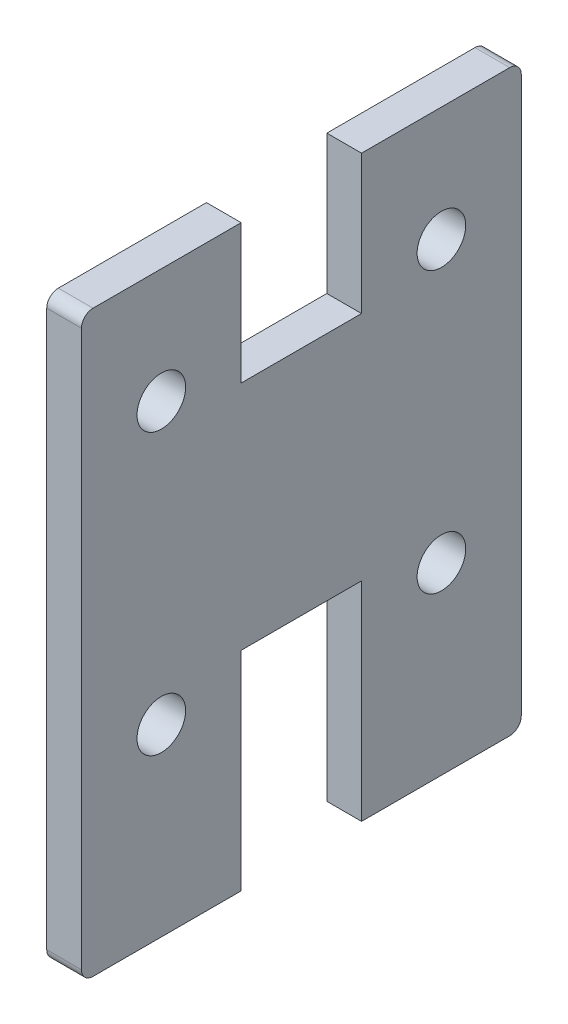
ISO-10303-21;
HEADER;
FILE_DESCRIPTION(('STEP AP214'),'2;1');
FILE_NAME('part.step','',(''),(''),'','','');
FILE_SCHEMA(('AUTOMOTIVE_DESIGN { 1 0 10303 214 1 1 1 1 }'));
ENDSEC;
DATA;
#1=APPLICATION_CONTEXT('core data for automotive mechanical design processes');
#2=APPLICATION_PROTOCOL_DEFINITION('international standard','automotive_design',2000,#1);
#3=PRODUCT_CONTEXT('',#1,'mechanical');
#4=PRODUCT('Part','Part','',(#3));
#5=PRODUCT_RELATED_PRODUCT_CATEGORY('part','',(#4));
#6=PRODUCT_DEFINITION_FORMATION('','',#4);
#7=PRODUCT_DEFINITION_CONTEXT('part definition',#1,'design');
#8=PRODUCT_DEFINITION('design','',#6,#7);
#9=PRODUCT_DEFINITION_SHAPE('','',#8);
#10=(LENGTH_UNIT() NAMED_UNIT(*) SI_UNIT(.MILLI.,.METRE.));
#11=(NAMED_UNIT(*) PLANE_ANGLE_UNIT() SI_UNIT($,.RADIAN.));
#12=(NAMED_UNIT(*) SI_UNIT($,.STERADIAN.) SOLID_ANGLE_UNIT());
#13=UNCERTAINTY_MEASURE_WITH_UNIT(LENGTH_MEASURE(1.E-05),#10,'distance_accuracy_value','');
#14=(GEOMETRIC_REPRESENTATION_CONTEXT(3) GLOBAL_UNCERTAINTY_ASSIGNED_CONTEXT((#13)) GLOBAL_UNIT_ASSIGNED_CONTEXT((#10,
#11,#12)) REPRESENTATION_CONTEXT('',''));
#15=CARTESIAN_POINT('',(0.,0.,0.));
#16=DIRECTION('',(0.,0.,1.));
#17=DIRECTION('',(1.,0.,0.));
#18=AXIS2_PLACEMENT_3D('',#15,#16,#17);
#19=CARTESIAN_POINT('',(-14.9999999999997,109.799999999999,96.0000000000015));
#20=DIRECTION('',(0.,-1.,0.));
#21=DIRECTION('',(0.,0.,-1.));
#22=AXIS2_PLACEMENT_3D('',#19,#20,#21);
#23=PLANE('',#22);
#24=DIRECTION('',(-1.00000000000002,0.,0.));
#25=VECTOR('',#24,1.);
#26=CARTESIAN_POINT('',(-14.9999999999997,109.799999999999,91.0000000000015));
#27=LINE('',#26,#25);
#28=CARTESIAN_POINT('',(-1.72723934494946E-12,109.800000000004,91.0000000000014));
#29=VERTEX_POINT('',#28);
#30=CARTESIAN_POINT('',(-14.9999999999997,109.799999999999,91.0000000000015));
#31=VERTEX_POINT('',#30);
#32=EDGE_CURVE('E11',#29,#31,#27,.T.);
#33=ORIENTED_EDGE('',*,*,#32,.F.);
#34=DIRECTION('',(0.,0.,1.));
#35=VECTOR('',#34,1.);
#36=CARTESIAN_POINT('',(-1.66424705339657E-12,109.800000000004,0.999999999999976));
#37=LINE('',#36,#35);
#38=CARTESIAN_POINT('',(-1.68244482651185E-12,109.800000000004,27.));
#39=VERTEX_POINT('',#38);
#40=EDGE_CURVE('E130',#29,#39,#37,.F.);
#41=ORIENTED_EDGE('',*,*,#40,.T.);
#42=DIRECTION('',(-1.00000000000002,0.,0.));
#43=VECTOR('',#42,1.);
#44=CARTESIAN_POINT('',(-14.9999999999997,109.799999999999,27.));
#45=LINE('',#44,#43);
#46=CARTESIAN_POINT('',(-14.9999999999997,109.799999999999,27.));
#47=VERTEX_POINT('',#46);
#48=EDGE_CURVE('E47',#39,#47,#45,.T.);
#49=ORIENTED_EDGE('',*,*,#48,.T.);
#50=DIRECTION('',(0.,0.,-1.));
#51=VECTOR('',#50,1.);
#52=CARTESIAN_POINT('',(-14.9999999999997,109.799999999999,96.0000000000015));
#53=LINE('',#52,#51);
#54=EDGE_CURVE('E229',#31,#47,#53,.T.);
#55=ORIENTED_EDGE('',*,*,#54,.F.);
#56=EDGE_LOOP('',(#33,#41,#49,#55));
#57=FACE_BOUND('',#56,.T.);
#58=ADVANCED_FACE('F37',(#57),#23,.F.);
#59=CARTESIAN_POINT('',(-14.9999999999997,109.799999999999,27.));
#60=DIRECTION('',(0.,0.,1.));
#61=DIRECTION('',(0.,-1.,0.));
#62=AXIS2_PLACEMENT_3D('',#59,#60,#61);
#63=PLANE('',#62);
#64=ORIENTED_EDGE('',*,*,#48,.F.);
#65=DIRECTION('',(0.,-1.00000000000002,0.));
#66=VECTOR('',#65,1.);
#67=CARTESIAN_POINT('',(4.05074755023061E-13,-0.199999999999845,27.));
#68=LINE('',#67,#66);
#69=CARTESIAN_POINT('',(-5.43797782038269E-13,49.8000000000023,27.));
#70=VERTEX_POINT('',#69);
#71=EDGE_CURVE('E173',#39,#70,#68,.T.);
#72=ORIENTED_EDGE('',*,*,#71,.T.);
#73=DIRECTION('',(-1.00000000000002,0.,0.));
#74=VECTOR('',#73,1.);
#75=CARTESIAN_POINT('',(-14.9999999999998,49.7999999999999,27.));
#76=LINE('',#75,#74);
#77=CARTESIAN_POINT('',(-14.9999999999998,49.7999999999999,27.));
#78=VERTEX_POINT('',#77);
#79=EDGE_CURVE('E222',#70,#78,#76,.T.);
#80=ORIENTED_EDGE('',*,*,#79,.T.);
#81=DIRECTION('',(0.,-1.,0.));
#82=VECTOR('',#81,1.);
#83=CARTESIAN_POINT('',(-14.9999999999997,109.799999999999,27.));
#84=LINE('',#83,#82);
#85=EDGE_CURVE('E239',#47,#78,#84,.T.);
#86=ORIENTED_EDGE('',*,*,#85,.F.);
#87=EDGE_LOOP('',(#64,#72,#80,#86));
#88=FACE_BOUND('',#87,.T.);
#89=ADVANCED_FACE('F242',(#88),#63,.F.);
#90=CARTESIAN_POINT('',(-14.9999999999998,49.7999999999999,27.));
#91=DIRECTION('',(0.,-1.,0.));
#92=DIRECTION('',(0.,0.,-1.));
#93=AXIS2_PLACEMENT_3D('',#90,#91,#92);
#94=PLANE('',#93);
#95=ORIENTED_EDGE('',*,*,#79,.F.);
#96=DIRECTION('',(0.,0.,1.));
#97=VECTOR('',#96,1.);
#98=CARTESIAN_POINT('',(-5.2560000892299E-13,49.8000000000023,0.999999999999983));
#99=LINE('',#98,#97);
#100=CARTESIAN_POINT('',(-5.0740223580771E-13,49.8000000000023,-25.));
#101=VERTEX_POINT('',#100);
#102=EDGE_CURVE('E170',#70,#101,#99,.F.);
#103=ORIENTED_EDGE('',*,*,#102,.T.);
#104=DIRECTION('',(-1.00000000000002,0.,0.));
#105=VECTOR('',#104,1.);
#106=CARTESIAN_POINT('',(-14.9999999999996,49.7999999999999,-25.));
#107=LINE('',#106,#105);
#108=CARTESIAN_POINT('',(-14.9999999999996,49.7999999999999,-25.));
#109=VERTEX_POINT('',#108);
#110=EDGE_CURVE('E219',#101,#109,#107,.T.);
#111=ORIENTED_EDGE('',*,*,#110,.T.);
#112=DIRECTION('',(0.,0.,-1.));
#113=VECTOR('',#112,1.);
#114=CARTESIAN_POINT('',(-14.9999999999998,49.7999999999999,27.));
#115=LINE('',#114,#113);
#116=EDGE_CURVE('E243',#78,#109,#115,.T.);
#117=ORIENTED_EDGE('',*,*,#116,.F.);
#118=EDGE_LOOP('',(#95,#103,#111,#117));
#119=FACE_BOUND('',#118,.T.);
#120=ADVANCED_FACE('F313',(#119),#94,.F.);
#121=CARTESIAN_POINT('',(-14.9999999999997,109.799999999999,-25.));
#122=DIRECTION('',(0.,0.,1.));
#123=DIRECTION('',(0.,-1.,0.));
#124=AXIS2_PLACEMENT_3D('',#121,#122,#123);
#125=PLANE('',#124);
#126=ORIENTED_EDGE('',*,*,#110,.F.);
#127=DIRECTION('',(0.,-1.00000000000002,0.));
#128=VECTOR('',#127,1.);
#129=CARTESIAN_POINT('',(4.41470301253621E-13,-0.199999999999851,-25.));
#130=LINE('',#129,#128);
#131=CARTESIAN_POINT('',(-1.64604928028129E-12,109.800000000004,-25.));
#132=VERTEX_POINT('',#131);
#133=EDGE_CURVE('E167',#132,#101,#130,.T.);
#134=ORIENTED_EDGE('',*,*,#133,.F.);
#135=DIRECTION('',(-1.00000000000002,0.,0.));
#136=VECTOR('',#135,1.);
#137=CARTESIAN_POINT('',(-14.9999999999997,109.799999999999,-25.));
#138=LINE('',#137,#136);
#139=CARTESIAN_POINT('',(-14.9999999999997,109.799999999999,-25.));
#140=VERTEX_POINT('',#139);
#141=EDGE_CURVE('E216',#132,#140,#138,.T.);
#142=ORIENTED_EDGE('',*,*,#141,.T.);
#143=DIRECTION('',(0.,-1.,0.));
#144=VECTOR('',#143,1.);
#145=CARTESIAN_POINT('',(-14.9999999999997,109.799999999999,-25.));
#146=LINE('',#145,#144);
#147=EDGE_CURVE('E245',#140,#109,#146,.T.);
#148=ORIENTED_EDGE('',*,*,#147,.T.);
#149=EDGE_LOOP('',(#126,#134,#142,#148));
#150=FACE_BOUND('',#149,.T.);
#151=ADVANCED_FACE('F464',(#150),#125,.T.);
#152=CARTESIAN_POINT('',(-14.9999999999992,109.799999999999,-94.0000000000006));
#153=DIRECTION('',(0.,1.,0.));
#154=DIRECTION('',(0.,0.,1.));
#155=AXIS2_PLACEMENT_3D('',#152,#153,#154);
#156=PLANE('',#155);
#157=ORIENTED_EDGE('',*,*,#141,.F.);
#158=DIRECTION('',(0.,0.,1.));
#159=VECTOR('',#158,1.);
#160=CARTESIAN_POINT('',(-1.66424705339657E-12,109.800000000004,0.999999999999976));
#161=LINE('',#160,#159);
#162=CARTESIAN_POINT('',(-1.60125476184368E-12,109.800000000004,-89.0000000000007));
#163=VERTEX_POINT('',#162);
#164=EDGE_CURVE('E164',#163,#132,#161,.T.);
#165=ORIENTED_EDGE('',*,*,#164,.F.);
#166=DIRECTION('',(-1.00000000000002,0.,0.));
#167=VECTOR('',#166,1.);
#168=CARTESIAN_POINT('',(-14.9999999999981,109.799999999999,-89.0000000000006));
#169=LINE('',#168,#167);
#170=CARTESIAN_POINT('',(-14.9999999999981,109.799999999999,-89.0000000000006));
#171=VERTEX_POINT('',#170);
#172=EDGE_CURVE('E213',#163,#171,#169,.T.);
#173=ORIENTED_EDGE('',*,*,#172,.T.);
#174=DIRECTION('',(0.,0.,1.));
#175=VECTOR('',#174,1.);
#176=CARTESIAN_POINT('',(-14.9999999999992,109.799999999999,-94.0000000000006));
#177=LINE('',#176,#175);
#178=EDGE_CURVE('E251',#171,#140,#177,.T.);
#179=ORIENTED_EDGE('',*,*,#178,.T.);
#180=EDGE_LOOP('',(#157,#165,#173,#179));
#181=FACE_BOUND('',#180,.T.);
#182=ADVANCED_FACE('F454',(#181),#156,.T.);
#183=CARTESIAN_POINT('',(-14.9999999999983,104.799999999999,-89.0000000000014));
#184=DIRECTION('',(1.00000000000002,0.,0.));
#185=DIRECTION('',(0.,1.,0.));
#186=AXIS2_PLACEMENT_3D('',#183,#184,#185);
#187=CYLINDRICAL_SURFACE('',#186,5.);
#188=ORIENTED_EDGE('',*,*,#172,.F.);
#189=CARTESIAN_POINT('',(2.71310751642773E-12,104.799999999999,-89.0000000000014));
#190=DIRECTION('',(1.00000000000002,0.,0.));
#191=DIRECTION('',(0.,1.,0.));
#192=AXIS2_PLACEMENT_3D('',#189,#190,#191);
#193=CIRCLE('',#192,5.);
#194=CARTESIAN_POINT('',(-1.50286793638461E-12,104.800000000004,-94.0000000000015));
#195=VERTEX_POINT('',#194);
#196=EDGE_CURVE('E161',#163,#195,#193,.F.);
#197=ORIENTED_EDGE('',*,*,#196,.T.);
#198=DIRECTION('',(-1.00000000000002,0.,0.));
#199=VECTOR('',#198,1.);
#200=CARTESIAN_POINT('',(-14.9999999999983,104.799999999999,-94.0000000000015));
#201=LINE('',#200,#199);
#202=CARTESIAN_POINT('',(-14.9999999999983,104.799999999999,-94.0000000000015));
#203=VERTEX_POINT('',#202);
#204=EDGE_CURVE('E210',#195,#203,#201,.T.);
#205=ORIENTED_EDGE('',*,*,#204,.T.);
#206=CARTESIAN_POINT('',(-14.9999999999983,104.799999999999,-89.0000000000014));
#207=DIRECTION('',(1.00000000000002,0.,0.));
#208=DIRECTION('',(0.,0.,1.));
#209=AXIS2_PLACEMENT_3D('',#206,#207,#208);
#210=CIRCLE('',#209,5.);
#211=EDGE_CURVE('E254',#171,#203,#210,.F.);
#212=ORIENTED_EDGE('',*,*,#211,.F.);
#213=EDGE_LOOP('',(#188,#197,#205,#212));
#214=FACE_BOUND('',#213,.T.);
#215=ADVANCED_FACE('F444',(#214),#187,.T.);
#216=CARTESIAN_POINT('',(-15.0000000000052,-42.1037546673445,-94.000000000004));
#217=DIRECTION('',(0.,0.,-1.));
#218=DIRECTION('',(0.,1.,0.));
#219=AXIS2_PLACEMENT_3D('',#216,#217,#218);
#220=PLANE('',#219);
#221=ORIENTED_EDGE('',*,*,#204,.F.);
#222=DIRECTION('',(0.,-1.00000000000002,0.));
#223=VECTOR('',#222,1.);
#224=CARTESIAN_POINT('',(4.89764391444173E-13,-0.199999999999859,-94.000000000004));
#225=LINE('',#224,#223);
#226=CARTESIAN_POINT('',(3.05172024150981E-12,-135.200000000008,-94.000000000004));
#227=VERTEX_POINT('',#226);
#228=EDGE_CURVE('E158',#227,#195,#225,.F.);
#229=ORIENTED_EDGE('',*,*,#228,.F.);
#230=DIRECTION('',(-1.00000000000002,0.,0.));
#231=VECTOR('',#230,1.);
#232=CARTESIAN_POINT('',(-15.0000000000049,-135.200000000003,-94.000000000004));
#233=LINE('',#232,#231);
#234=CARTESIAN_POINT('',(-15.0000000000049,-135.200000000003,-94.000000000004));
#235=VERTEX_POINT('',#234);
#236=EDGE_CURVE('E207',#227,#235,#233,.T.);
#237=ORIENTED_EDGE('',*,*,#236,.T.);
#238=DIRECTION('',(0.,1.,0.));
#239=VECTOR('',#238,1.);
#240=CARTESIAN_POINT('',(-15.0000000000052,-42.1037546673445,-94.000000000004));
#241=LINE('',#240,#239);
#242=EDGE_CURVE('E257',#235,#203,#241,.T.);
#243=ORIENTED_EDGE('',*,*,#242,.T.);
#244=EDGE_LOOP('',(#221,#229,#237,#243));
#245=FACE_BOUND('',#244,.T.);
#246=ADVANCED_FACE('F434',(#245),#220,.T.);
#247=CARTESIAN_POINT('',(-15.0000000000049,-135.200000000003,-89.000000000004));
#248=DIRECTION('',(1.00000000000002,0.,0.));
#249=DIRECTION('',(0.,1.,0.));
#250=AXIS2_PLACEMENT_3D('',#247,#248,#249);
#251=CYLINDRICAL_SURFACE('',#250,5.);
#252=ORIENTED_EDGE('',*,*,#236,.F.);
#253=CARTESIAN_POINT('',(-3.89271948009196E-12,-135.200000000002,-89.000000000004));
#254=DIRECTION('',(1.00000000000002,0.,0.));
#255=DIRECTION('',(0.,1.,0.));
#256=AXIS2_PLACEMENT_3D('',#253,#254,#255);
#257=CIRCLE('',#256,5.);
#258=CARTESIAN_POINT('',(3.14310792346296E-12,-140.200000000006,-89.000000000004));
#259=VERTEX_POINT('',#258);
#260=EDGE_CURVE('E155',#227,#259,#257,.F.);
#261=ORIENTED_EDGE('',*,*,#260,.T.);
#262=DIRECTION('',(-1.00000000000002,0.,0.));
#263=VECTOR('',#262,1.);
#264=CARTESIAN_POINT('',(-15.0000000000016,-140.2,-89.000000000004));
#265=LINE('',#264,#263);
#266=CARTESIAN_POINT('',(-15.0000000000016,-140.2,-89.000000000004));
#267=VERTEX_POINT('',#266);
#268=EDGE_CURVE('E204',#259,#267,#265,.T.);
#269=ORIENTED_EDGE('',*,*,#268,.T.);
#270=CARTESIAN_POINT('',(-15.0000000000049,-135.200000000003,-89.000000000004));
#271=DIRECTION('',(1.00000000000002,0.,0.));
#272=DIRECTION('',(0.,0.,1.));
#273=AXIS2_PLACEMENT_3D('',#270,#271,#272);
#274=CIRCLE('',#273,5.);
#275=EDGE_CURVE('E260',#235,#267,#274,.F.);
#276=ORIENTED_EDGE('',*,*,#275,.F.);
#277=EDGE_LOOP('',(#252,#261,#269,#276));
#278=FACE_BOUND('',#277,.T.);
#279=ADVANCED_FACE('F424',(#278),#251,.T.);
#280=CARTESIAN_POINT('',(-15.0000000000032,-140.2,-94.000000000004));
#281=DIRECTION('',(0.,-1.,0.));
#282=DIRECTION('',(0.,0.,-1.));
#283=AXIS2_PLACEMENT_3D('',#280,#281,#282);
#284=PLANE('',#283);
#285=ORIENTED_EDGE('',*,*,#268,.F.);
#286=DIRECTION('',(0.,0.,1.));
#287=VECTOR('',#286,1.);
#288=CARTESIAN_POINT('',(3.08011563191005E-12,-140.200000000005,1.00000000000001));
#289=LINE('',#288,#287);
#290=CARTESIAN_POINT('',(3.09831340502532E-12,-140.200000000005,-24.9999999999999));
#291=VERTEX_POINT('',#290);
#292=EDGE_CURVE('E152',#291,#259,#289,.F.);
#293=ORIENTED_EDGE('',*,*,#292,.F.);
#294=DIRECTION('',(-1.00000000000002,0.,0.));
#295=VECTOR('',#294,1.);
#296=CARTESIAN_POINT('',(-15.0000000000049,-140.199999999999,-24.9999999999999));
#297=LINE('',#296,#295);
#298=CARTESIAN_POINT('',(-15.0000000000049,-140.199999999999,-24.9999999999999));
#299=VERTEX_POINT('',#298);
#300=EDGE_CURVE('E201',#291,#299,#297,.T.);
#301=ORIENTED_EDGE('',*,*,#300,.T.);
#302=DIRECTION('',(0.,0.,-1.));
#303=VECTOR('',#302,1.);
#304=CARTESIAN_POINT('',(-15.0000000000032,-140.2,-94.000000000004));
#305=LINE('',#304,#303);
#306=EDGE_CURVE('E263',#299,#267,#305,.T.);
#307=ORIENTED_EDGE('',*,*,#306,.T.);
#308=EDGE_LOOP('',(#285,#293,#301,#307));
#309=FACE_BOUND('',#308,.T.);
#310=ADVANCED_FACE('F414',(#309),#284,.T.);
#311=CARTESIAN_POINT('',(-15.0000000000049,-140.199999999999,-24.9999999999999));
#312=DIRECTION('',(0.,0.,1.));
#313=DIRECTION('',(0.,-1.,0.));
#314=AXIS2_PLACEMENT_3D('',#311,#312,#313);
#315=PLANE('',#314);
#316=ORIENTED_EDGE('',*,*,#300,.F.);
#317=DIRECTION('',(0.,-1.00000000000002,0.));
#318=VECTOR('',#317,1.);
#319=CARTESIAN_POINT('',(4.41470301253621E-13,-0.199999999999851,-25.));
#320=LINE('',#319,#318);
#321=CARTESIAN_POINT('',(1.39034283831495E-12,-50.200000000002,-25.));
#322=VERTEX_POINT('',#321);
#323=EDGE_CURVE('E149',#322,#291,#320,.T.);
#324=ORIENTED_EDGE('',*,*,#323,.F.);
#325=DIRECTION('',(-1.00000000000002,0.,0.));
#326=VECTOR('',#325,1.);
#327=CARTESIAN_POINT('',(-15.0000000000003,-50.2000000000001,-25.));
#328=LINE('',#327,#326);
#329=CARTESIAN_POINT('',(-15.0000000000003,-50.2000000000001,-25.));
#330=VERTEX_POINT('',#329);
#331=EDGE_CURVE('E198',#322,#330,#328,.T.);
#332=ORIENTED_EDGE('',*,*,#331,.T.);
#333=DIRECTION('',(0.,-1.,0.));
#334=VECTOR('',#333,1.);
#335=CARTESIAN_POINT('',(-15.0000000000049,-140.199999999999,-24.9999999999999));
#336=LINE('',#335,#334);
#337=EDGE_CURVE('E266',#330,#299,#336,.T.);
#338=ORIENTED_EDGE('',*,*,#337,.T.);
#339=EDGE_LOOP('',(#316,#324,#332,#338));
#340=FACE_BOUND('',#339,.T.);
#341=ADVANCED_FACE('F404',(#340),#315,.T.);
#342=CARTESIAN_POINT('',(-15.0000000000003,-50.2000000000001,27.));
#343=DIRECTION('',(0.,1.,0.));
#344=DIRECTION('',(0.,0.,1.));
#345=AXIS2_PLACEMENT_3D('',#342,#343,#344);
#346=PLANE('',#345);
#347=ORIENTED_EDGE('',*,*,#331,.F.);
#348=DIRECTION('',(0.,0.,1.));
#349=VECTOR('',#348,1.);
#350=CARTESIAN_POINT('',(1.37214506519967E-12,-50.200000000002,0.999999999999995));
#351=LINE('',#350,#349);
#352=CARTESIAN_POINT('',(1.35394729208439E-12,-50.200000000002,27.));
#353=VERTEX_POINT('',#352);
#354=EDGE_CURVE('E146',#322,#353,#351,.T.);
#355=ORIENTED_EDGE('',*,*,#354,.T.);
#356=DIRECTION('',(-1.00000000000002,0.,0.));
#357=VECTOR('',#356,1.);
#358=CARTESIAN_POINT('',(-15.0000000000003,-50.2000000000001,27.));
#359=LINE('',#358,#357);
#360=CARTESIAN_POINT('',(-15.0000000000003,-50.2000000000001,27.));
#361=VERTEX_POINT('',#360);
#362=EDGE_CURVE('E195',#353,#361,#359,.T.);
#363=ORIENTED_EDGE('',*,*,#362,.T.);
#364=DIRECTION('',(0.,0.,1.));
#365=VECTOR('',#364,1.);
#366=CARTESIAN_POINT('',(-15.0000000000003,-50.2000000000001,27.));
#367=LINE('',#366,#365);
#368=EDGE_CURVE('E269',#330,#361,#367,.T.);
#369=ORIENTED_EDGE('',*,*,#368,.F.);
#370=EDGE_LOOP('',(#347,#355,#363,#369));
#371=FACE_BOUND('',#370,.T.);
#372=ADVANCED_FACE('F394',(#371),#346,.F.);
#373=CARTESIAN_POINT('',(-15.0000000000006,-140.199999999999,27.));
#374=DIRECTION('',(0.,0.,1.));
#375=DIRECTION('',(0.,-1.,0.));
#376=AXIS2_PLACEMENT_3D('',#373,#374,#375);
#377=PLANE('',#376);
#378=ORIENTED_EDGE('',*,*,#362,.F.);
#379=DIRECTION('',(0.,-1.00000000000002,0.));
#380=VECTOR('',#379,1.);
#381=CARTESIAN_POINT('',(4.05074755023061E-13,-0.199999999999845,27.));
#382=LINE('',#381,#380);
#383=CARTESIAN_POINT('',(3.06191785879477E-12,-140.200000000005,27.));
#384=VERTEX_POINT('',#383);
#385=EDGE_CURVE('E143',#353,#384,#382,.T.);
#386=ORIENTED_EDGE('',*,*,#385,.T.);
#387=DIRECTION('',(-1.00000000000002,0.,0.));
#388=VECTOR('',#387,1.);
#389=CARTESIAN_POINT('',(-15.0000000000006,-140.199999999999,27.));
#390=LINE('',#389,#388);
#391=CARTESIAN_POINT('',(-15.0000000000006,-140.199999999999,27.));
#392=VERTEX_POINT('',#391);
#393=EDGE_CURVE('E192',#384,#392,#390,.T.);
#394=ORIENTED_EDGE('',*,*,#393,.T.);
#395=DIRECTION('',(0.,-1.,0.));
#396=VECTOR('',#395,1.);
#397=CARTESIAN_POINT('',(-15.0000000000006,-140.199999999999,27.));
#398=LINE('',#397,#396);
#399=EDGE_CURVE('E272',#361,#392,#398,.T.);
#400=ORIENTED_EDGE('',*,*,#399,.F.);
#401=EDGE_LOOP('',(#378,#386,#394,#400));
#402=FACE_BOUND('',#401,.T.);
#403=ADVANCED_FACE('F384',(#402),#377,.F.);
#404=CARTESIAN_POINT('',(-15.0000000000006,-140.2,96.000000000004));
#405=DIRECTION('',(0.,1.,0.));
#406=DIRECTION('',(0.,0.,1.));
#407=AXIS2_PLACEMENT_3D('',#404,#405,#406);
#408=PLANE('',#407);
#409=ORIENTED_EDGE('',*,*,#393,.F.);
#410=DIRECTION('',(0.,0.,1.));
#411=VECTOR('',#410,1.);
#412=CARTESIAN_POINT('',(3.08011563191005E-12,-140.200000000005,1.00000000000001));
#413=LINE('',#412,#411);
#414=CARTESIAN_POINT('',(3.01712334035716E-12,-140.200000000005,91.000000000004));
#415=VERTEX_POINT('',#414);
#416=EDGE_CURVE('E140',#384,#415,#413,.T.);
#417=ORIENTED_EDGE('',*,*,#416,.T.);
#418=DIRECTION('',(-1.00000000000002,0.,0.));
#419=VECTOR('',#418,1.);
#420=CARTESIAN_POINT('',(-15.0000000000006,-140.2,91.000000000004));
#421=LINE('',#420,#419);
#422=CARTESIAN_POINT('',(-15.0000000000006,-140.2,91.000000000004));
#423=VERTEX_POINT('',#422);
#424=EDGE_CURVE('E190',#415,#423,#421,.T.);
#425=ORIENTED_EDGE('',*,*,#424,.T.);
#426=DIRECTION('',(0.,0.,1.));
#427=VECTOR('',#426,1.);
#428=CARTESIAN_POINT('',(-15.0000000000006,-140.2,96.000000000004));
#429=LINE('',#428,#427);
#430=EDGE_CURVE('E275',#392,#423,#429,.T.);
#431=ORIENTED_EDGE('',*,*,#430,.F.);
#432=EDGE_LOOP('',(#409,#417,#425,#431));
#433=FACE_BOUND('',#432,.T.);
#434=ADVANCED_FACE('F375',(#433),#408,.F.);
#435=CARTESIAN_POINT('',(-15.0000000000025,-135.200000000002,91.000000000004));
#436=DIRECTION('',(1.00000000000002,0.,0.));
#437=DIRECTION('',(0.,1.,0.));
#438=AXIS2_PLACEMENT_3D('',#435,#436,#437);
#439=CYLINDRICAL_SURFACE('',#438,5.);
#440=ORIENTED_EDGE('',*,*,#424,.F.);
#441=CARTESIAN_POINT('',(-1.5334955527635E-12,-135.200000000002,91.000000000004));
#442=DIRECTION('',(1.00000000000002,0.,0.));
#443=DIRECTION('',(0.,1.,0.));
#444=AXIS2_PLACEMENT_3D('',#441,#442,#443);
#445=CIRCLE('',#444,5.);
#446=CARTESIAN_POINT('',(2.91873651489813E-12,-135.200000000007,96.000000000004));
#447=VERTEX_POINT('',#446);
#448=EDGE_CURVE('E137',#415,#447,#445,.F.);
#449=ORIENTED_EDGE('',*,*,#448,.T.);
#450=DIRECTION('',(-1.00000000000002,0.,0.));
#451=VECTOR('',#450,1.);
#452=CARTESIAN_POINT('',(-15.0000000000049,-135.200000000002,96.000000000004));
#453=LINE('',#452,#451);
#454=CARTESIAN_POINT('',(-15.0000000000049,-135.200000000002,96.000000000004));
#455=VERTEX_POINT('',#454);
#456=EDGE_CURVE('E55',#447,#455,#453,.T.);
#457=ORIENTED_EDGE('',*,*,#456,.T.);
#458=CARTESIAN_POINT('',(-15.0000000000025,-135.200000000002,91.000000000004));
#459=DIRECTION('',(1.00000000000002,0.,0.));
#460=DIRECTION('',(0.,0.,1.));
#461=AXIS2_PLACEMENT_3D('',#458,#459,#460);
#462=CIRCLE('',#461,5.);
#463=EDGE_CURVE('E278',#423,#455,#462,.F.);
#464=ORIENTED_EDGE('',*,*,#463,.F.);
#465=EDGE_LOOP('',(#440,#449,#457,#464));
#466=FACE_BOUND('',#465,.T.);
#467=ADVANCED_FACE('F367',(#466),#439,.T.);
#468=CARTESIAN_POINT('',(-15.0000000000045,-42.1037546673445,96.000000000004));
#469=DIRECTION('',(0.,0.,-1.));
#470=DIRECTION('',(0.,1.,0.));
#471=AXIS2_PLACEMENT_3D('',#468,#469,#470);
#472=PLANE('',#471);
#473=ORIENTED_EDGE('',*,*,#456,.F.);
#474=DIRECTION('',(0.,-1.00000000000002,0.));
#475=VECTOR('',#474,1.);
#476=CARTESIAN_POINT('',(3.56780664832509E-13,-0.199999999999837,96.000000000004));
#477=LINE('',#476,#475);
#478=CARTESIAN_POINT('',(-1.63585166299627E-12,104.800000000004,96.0000000000019));
#479=VERTEX_POINT('',#478);
#480=EDGE_CURVE('E128',#447,#479,#477,.F.);
#481=ORIENTED_EDGE('',*,*,#480,.T.);
#482=DIRECTION('',(-1.00000000000002,0.,0.));
#483=VECTOR('',#482,1.);
#484=CARTESIAN_POINT('',(-14.9999999999998,104.799999999999,96.0000000000019));
#485=LINE('',#484,#483);
#486=CARTESIAN_POINT('',(-14.9999999999998,104.799999999999,96.0000000000019));
#487=VERTEX_POINT('',#486);
#488=EDGE_CURVE('E41',#479,#487,#485,.T.);
#489=ORIENTED_EDGE('',*,*,#488,.T.);
#490=DIRECTION('',(0.,1.,0.));
#491=VECTOR('',#490,1.);
#492=CARTESIAN_POINT('',(-15.0000000000045,-42.1037546673445,96.000000000004));
#493=LINE('',#492,#491);
#494=EDGE_CURVE('E188',#455,#487,#493,.T.);
#495=ORIENTED_EDGE('',*,*,#494,.F.);
#496=EDGE_LOOP('',(#473,#481,#489,#495));
#497=FACE_BOUND('',#496,.T.);
#498=ADVANCED_FACE('F132',(#497),#472,.F.);
#499=CARTESIAN_POINT('',(-14.9999999999988,104.799999999999,91.000000000002));
#500=DIRECTION('',(1.00000000000002,0.,0.));
#501=DIRECTION('',(0.,1.,0.));
#502=AXIS2_PLACEMENT_3D('',#499,#500,#501);
#503=CYLINDRICAL_SURFACE('',#502,5.);
#504=CARTESIAN_POINT('',(2.15799600411515E-12,104.799999999999,91.000000000002));
#505=DIRECTION('',(1.00000000000002,0.,0.));
#506=DIRECTION('',(0.,1.,0.));
#507=AXIS2_PLACEMENT_3D('',#504,#505,#506);
#508=CIRCLE('',#507,5.);
#509=EDGE_CURVE('E116',#479,#29,#508,.F.);
#510=ORIENTED_EDGE('',*,*,#509,.T.);
#511=ORIENTED_EDGE('',*,*,#32,.T.);
#512=CARTESIAN_POINT('',(-14.9999999999988,104.799999999999,91.000000000002));
#513=DIRECTION('',(1.00000000000002,0.,0.));
#514=DIRECTION('',(0.,0.,1.));
#515=AXIS2_PLACEMENT_3D('',#512,#513,#514);
#516=CIRCLE('',#515,5.);
#517=EDGE_CURVE('E118',#487,#31,#516,.F.);
#518=ORIENTED_EDGE('',*,*,#517,.F.);
#519=ORIENTED_EDGE('',*,*,#488,.F.);
#520=EDGE_LOOP('',(#510,#511,#518,#519));
#521=FACE_BOUND('',#520,.T.);
#522=ADVANCED_FACE('F115',(#521),#503,.T.);
#523=CARTESIAN_POINT('',(-15.0000000000002,-60.7000000000001,61.5000000000039));
#524=DIRECTION('',(1.00000000000002,0.,0.));
#525=DIRECTION('',(0.,1.,0.));
#526=AXIS2_PLACEMENT_3D('',#523,#524,#525);
#527=CYLINDRICAL_SURFACE('',#526,10.5);
#528=CARTESIAN_POINT('',(-15.0000000000002,-60.7000000000001,61.5000000000039));
#529=DIRECTION('',(-1.00000000000002,0.,0.));
#530=DIRECTION('',(0.,0.,-1.));
#531=AXIS2_PLACEMENT_3D('',#528,#529,#530);
#532=CIRCLE('',#531,10.5);
#533=CARTESIAN_POINT('',(-15.0000000000002,-60.7000000000001,51.0000000000039));
#534=VERTEX_POINT('',#533);
#535=EDGE_CURVE('E281',#534,#534,#532,.T.);
#536=ORIENTED_EDGE('',*,*,#535,.T.);
#537=EDGE_LOOP('',(#536));
#538=FACE_BOUND('',#537,.T.);
#539=CARTESIAN_POINT('',(7.97972798949331E-13,-60.6999999999998,61.5000000000039));
#540=DIRECTION('',(-1.00000000000002,0.,0.));
#541=DIRECTION('',(0.,-1.,0.));
#542=AXIS2_PLACEMENT_3D('',#539,#540,#541);
#543=CIRCLE('',#542,10.5);
#544=CARTESIAN_POINT('',(9.97236031732202E-13,-71.1999999999998,61.5000000000039));
#545=VERTEX_POINT('',#544);
#546=EDGE_CURVE('E139',#545,#545,#543,.T.);
#547=ORIENTED_EDGE('',*,*,#546,.F.);
#548=EDGE_LOOP('',(#547));
#549=FACE_BOUND('',#548,.T.);
#550=ADVANCED_FACE('F319',(#538,#549),#527,.F.);
#551=CARTESIAN_POINT('',(-14.9999999999977,60.2999999999996,61.5000000000019));
#552=DIRECTION('',(1.00000000000002,0.,0.));
#553=DIRECTION('',(0.,1.,0.));
#554=AXIS2_PLACEMENT_3D('',#551,#552,#553);
#555=CYLINDRICAL_SURFACE('',#554,10.5);
#556=CARTESIAN_POINT('',(-14.9999999999977,60.2999999999996,61.5000000000019));
#557=DIRECTION('',(-1.00000000000002,0.,0.));
#558=DIRECTION('',(0.,0.,-1.));
#559=AXIS2_PLACEMENT_3D('',#556,#557,#558);
#560=CIRCLE('',#559,10.5);
#561=CARTESIAN_POINT('',(-14.9999999999977,60.2999999999996,51.0000000000019));
#562=VERTEX_POINT('',#561);
#563=EDGE_CURVE('E284',#562,#562,#560,.T.);
#564=ORIENTED_EDGE('',*,*,#563,.T.);
#565=EDGE_LOOP('',(#564));
#566=FACE_BOUND('',#565,.T.);
#567=CARTESIAN_POINT('',(3.2682190287403E-12,60.2999999999998,61.5000000000019));
#568=DIRECTION('',(-1.00000000000002,0.,0.));
#569=DIRECTION('',(0.,-1.,0.));
#570=AXIS2_PLACEMENT_3D('',#567,#568,#569);
#571=CIRCLE('',#570,10.5);
#572=CARTESIAN_POINT('',(3.46748226152318E-12,49.7999999999998,61.5000000000019));
#573=VERTEX_POINT('',#572);
#574=EDGE_CURVE('E179',#573,#573,#571,.T.);
#575=ORIENTED_EDGE('',*,*,#574,.F.);
#576=EDGE_LOOP('',(#575));
#577=FACE_BOUND('',#576,.T.);
#578=ADVANCED_FACE('F322',(#566,#577),#555,.F.);
#579=CARTESIAN_POINT('',(-14.9999999999975,60.2999999999995,-59.5000000000015));
#580=DIRECTION('',(1.00000000000002,0.,0.));
#581=DIRECTION('',(0.,1.,0.));
#582=AXIS2_PLACEMENT_3D('',#579,#580,#581);
#583=CYLINDRICAL_SURFACE('',#582,10.5);
#584=CARTESIAN_POINT('',(-14.9999999999975,60.2999999999995,-59.5000000000015));
#585=DIRECTION('',(1.00000000000002,0.,0.));
#586=DIRECTION('',(0.,0.,1.));
#587=AXIS2_PLACEMENT_3D('',#584,#585,#586);
#588=CIRCLE('',#587,10.5);
#589=CARTESIAN_POINT('',(-14.9999999999975,60.2999999999995,-49.0000000000015));
#590=VERTEX_POINT('',#589);
#591=EDGE_CURVE('E286',#590,#590,#588,.T.);
#592=ORIENTED_EDGE('',*,*,#591,.F.);
#593=EDGE_LOOP('',(#592));
#594=FACE_BOUND('',#593,.T.);
#595=CARTESIAN_POINT('',(3.49026363366534E-12,60.2999999999998,-59.5000000000016));
#596=DIRECTION('',(1.00000000000002,0.,0.));
#597=DIRECTION('',(0.,1.,0.));
#598=AXIS2_PLACEMENT_3D('',#595,#596,#597);
#599=CIRCLE('',#598,10.5);
#600=CARTESIAN_POINT('',(3.29100040088247E-12,70.7999999999998,-59.5000000000016));
#601=VERTEX_POINT('',#600);
#602=EDGE_CURVE('E182',#601,#601,#599,.T.);
#603=ORIENTED_EDGE('',*,*,#602,.T.);
#604=EDGE_LOOP('',(#603));
#605=FACE_BOUND('',#604,.T.);
#606=ADVANCED_FACE('F296',(#594,#605),#583,.F.);
#607=CARTESIAN_POINT('',(-15.0000000000001,-60.7000000000001,-59.5000000000039));
#608=DIRECTION('',(1.00000000000002,0.,0.));
#609=DIRECTION('',(0.,1.,0.));
#610=AXIS2_PLACEMENT_3D('',#607,#608,#609);
#611=CYLINDRICAL_SURFACE('',#610,10.5);
#612=CARTESIAN_POINT('',(-15.0000000000001,-60.7000000000001,-59.5000000000039));
#613=DIRECTION('',(1.00000000000002,0.,0.));
#614=DIRECTION('',(0.,0.,1.));
#615=AXIS2_PLACEMENT_3D('',#612,#613,#614);
#616=CIRCLE('',#615,10.5);
#617=CARTESIAN_POINT('',(-15.0000000000001,-60.7000000000001,-49.0000000000039));
#618=VERTEX_POINT('',#617);
#619=EDGE_CURVE('E122',#618,#618,#616,.T.);
#620=ORIENTED_EDGE('',*,*,#619,.F.);
#621=EDGE_LOOP('',(#620));
#622=FACE_BOUND('',#621,.T.);
#623=CARTESIAN_POINT('',(9.08995101411847E-13,-60.6999999999998,-59.5000000000039));
#624=DIRECTION('',(1.00000000000002,0.,0.));
#625=DIRECTION('',(0.,1.,0.));
#626=AXIS2_PLACEMENT_3D('',#623,#624,#625);
#627=CIRCLE('',#626,10.5);
#628=CARTESIAN_POINT('',(7.09731868628976E-13,-50.1999999999998,-59.5000000000039));
#629=VERTEX_POINT('',#628);
#630=EDGE_CURVE('E185',#629,#629,#627,.T.);
#631=ORIENTED_EDGE('',*,*,#630,.T.);
#632=EDGE_LOOP('',(#631));
#633=FACE_BOUND('',#632,.T.);
#634=ADVANCED_FACE('F39',(#622,#633),#611,.F.);
#635=CARTESIAN_POINT('',(-14.9999999999999,-0.200000000000132,1.));
#636=DIRECTION('',(1.00000000000002,0.,0.));
#637=DIRECTION('',(0.,0.,1.));
#638=AXIS2_PLACEMENT_3D('',#635,#636,#637);
#639=PLANE('',#638);
#640=ORIENTED_EDGE('',*,*,#494,.T.);
#641=ORIENTED_EDGE('',*,*,#517,.T.);
#642=ORIENTED_EDGE('',*,*,#54,.T.);
#643=ORIENTED_EDGE('',*,*,#85,.T.);
#644=ORIENTED_EDGE('',*,*,#116,.T.);
#645=ORIENTED_EDGE('',*,*,#147,.F.);
#646=ORIENTED_EDGE('',*,*,#178,.F.);
#647=ORIENTED_EDGE('',*,*,#211,.T.);
#648=ORIENTED_EDGE('',*,*,#242,.F.);
#649=ORIENTED_EDGE('',*,*,#275,.T.);
#650=ORIENTED_EDGE('',*,*,#306,.F.);
#651=ORIENTED_EDGE('',*,*,#337,.F.);
#652=ORIENTED_EDGE('',*,*,#368,.T.);
#653=ORIENTED_EDGE('',*,*,#399,.T.);
#654=ORIENTED_EDGE('',*,*,#430,.T.);
#655=ORIENTED_EDGE('',*,*,#463,.T.);
#656=EDGE_LOOP('',(#640,#641,#642,#643,#644,#645,#646,#647,#648,#649,#650,#651,#652,#653,#654,#655));
#657=FACE_BOUND('',#656,.T.);
#658=ORIENTED_EDGE('',*,*,#535,.F.);
#659=EDGE_LOOP('',(#658));
#660=FACE_BOUND('',#659,.T.);
#661=ORIENTED_EDGE('',*,*,#563,.F.);
#662=EDGE_LOOP('',(#661));
#663=FACE_BOUND('',#662,.T.);
#664=ORIENTED_EDGE('',*,*,#591,.T.);
#665=EDGE_LOOP('',(#664));
#666=FACE_BOUND('',#665,.T.);
#667=ORIENTED_EDGE('',*,*,#619,.T.);
#668=EDGE_LOOP('',(#667));
#669=FACE_BOUND('',#668,.T.);
#670=ADVANCED_FACE('F236',(#657,#660,#663,#666,#669),#639,.F.);
#671=CARTESIAN_POINT('',(4.23272528138341E-13,-0.199999999999848,0.999999999999989));
#672=DIRECTION('',(1.00000000000002,0.,0.));
#673=DIRECTION('',(0.,0.,1.));
#674=AXIS2_PLACEMENT_3D('',#671,#672,#673);
#675=PLANE('',#674);
#676=ORIENTED_EDGE('',*,*,#480,.F.);
#677=ORIENTED_EDGE('',*,*,#448,.F.);
#678=ORIENTED_EDGE('',*,*,#416,.F.);
#679=ORIENTED_EDGE('',*,*,#385,.F.);
#680=ORIENTED_EDGE('',*,*,#354,.F.);
#681=ORIENTED_EDGE('',*,*,#323,.T.);
#682=ORIENTED_EDGE('',*,*,#292,.T.);
#683=ORIENTED_EDGE('',*,*,#260,.F.);
#684=ORIENTED_EDGE('',*,*,#228,.T.);
#685=ORIENTED_EDGE('',*,*,#196,.F.);
#686=ORIENTED_EDGE('',*,*,#164,.T.);
#687=ORIENTED_EDGE('',*,*,#133,.T.);
#688=ORIENTED_EDGE('',*,*,#102,.F.);
#689=ORIENTED_EDGE('',*,*,#71,.F.);
#690=ORIENTED_EDGE('',*,*,#40,.F.);
#691=ORIENTED_EDGE('',*,*,#509,.F.);
#692=EDGE_LOOP('',(#676,#677,#678,#679,#680,#681,#682,#683,#684,#685,#686,#687,#688,#689,#690,#691));
#693=FACE_BOUND('',#692,.T.);
#694=ORIENTED_EDGE('',*,*,#546,.T.);
#695=EDGE_LOOP('',(#694));
#696=FACE_BOUND('',#695,.T.);
#697=ORIENTED_EDGE('',*,*,#574,.T.);
#698=EDGE_LOOP('',(#697));
#699=FACE_BOUND('',#698,.T.);
#700=ORIENTED_EDGE('',*,*,#602,.F.);
#701=EDGE_LOOP('',(#700));
#702=FACE_BOUND('',#701,.T.);
#703=ORIENTED_EDGE('',*,*,#630,.F.);
#704=EDGE_LOOP('',(#703));
#705=FACE_BOUND('',#704,.T.);
#706=ADVANCED_FACE('F125',(#693,#696,#699,#702,#705),#675,.T.);
#707=CLOSED_SHELL('',(#58,#89,#120,#151,#182,#215,#246,#279,#310,#341,#372,#403,#434,#467,#498,
#522,#550,#578,#606,#634,#670,#706));
#708=MANIFOLD_SOLID_BREP('B2',#707);
#709=ADVANCED_BREP_SHAPE_REPRESENTATION('',(#18,#708),#14);
#710=SHAPE_DEFINITION_REPRESENTATION(#9,#709);
ENDSEC;
END-ISO-10303-21;
